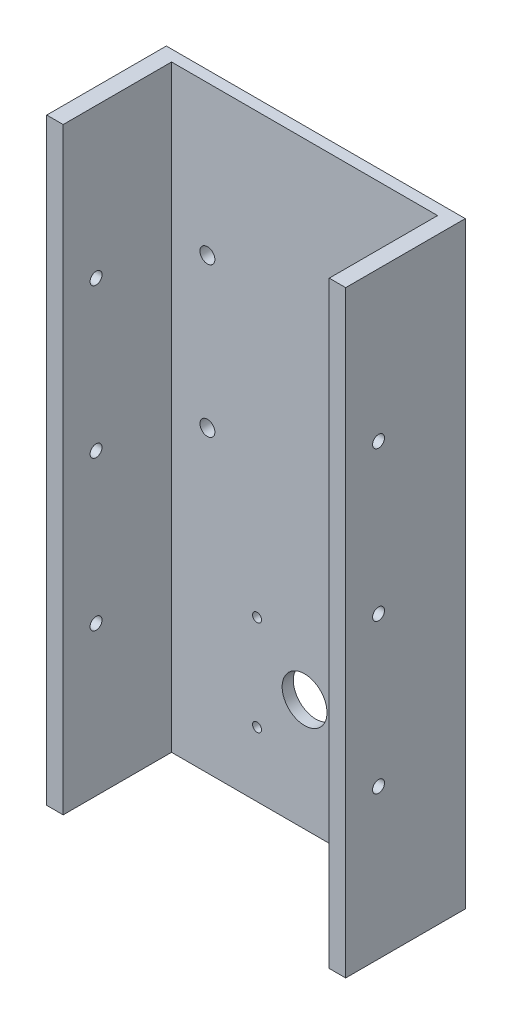
ISO-10303-21;
HEADER;
FILE_DESCRIPTION(('STEP AP214'),'2;1');
FILE_NAME('part.step','',(''),(''),'','','');
FILE_SCHEMA(('AUTOMOTIVE_DESIGN { 1 0 10303 214 1 1 1 1 }'));
ENDSEC;
DATA;
#1=APPLICATION_CONTEXT('core data for automotive mechanical design processes');
#2=APPLICATION_PROTOCOL_DEFINITION('international standard','automotive_design',2000,#1);
#3=PRODUCT_CONTEXT('',#1,'mechanical');
#4=PRODUCT('Part','Part','',(#3));
#5=PRODUCT_RELATED_PRODUCT_CATEGORY('part','',(#4));
#6=PRODUCT_DEFINITION_FORMATION('','',#4);
#7=PRODUCT_DEFINITION_CONTEXT('part definition',#1,'design');
#8=PRODUCT_DEFINITION('design','',#6,#7);
#9=PRODUCT_DEFINITION_SHAPE('','',#8);
#10=(LENGTH_UNIT() NAMED_UNIT(*) SI_UNIT(.MILLI.,.METRE.));
#11=(NAMED_UNIT(*) PLANE_ANGLE_UNIT() SI_UNIT($,.RADIAN.));
#12=(NAMED_UNIT(*) SI_UNIT($,.STERADIAN.) SOLID_ANGLE_UNIT());
#13=UNCERTAINTY_MEASURE_WITH_UNIT(LENGTH_MEASURE(1.E-05),#10,'distance_accuracy_value','');
#14=(GEOMETRIC_REPRESENTATION_CONTEXT(3) GLOBAL_UNCERTAINTY_ASSIGNED_CONTEXT((#13)) GLOBAL_UNIT_ASSIGNED_CONTEXT((#10,
#11,#12)) REPRESENTATION_CONTEXT('',''));
#15=CARTESIAN_POINT('',(0.,0.,0.));
#16=DIRECTION('',(0.,0.,1.));
#17=DIRECTION('',(1.,0.,0.));
#18=AXIS2_PLACEMENT_3D('',#15,#16,#17);
#19=CARTESIAN_POINT('',(0.,0.,7.5));
#20=DIRECTION('',(0.,0.,-1.));
#21=DIRECTION('',(-1.,0.,0.));
#22=AXIS2_PLACEMENT_3D('',#19,#20,#21);
#23=PLANE('',#22);
#24=CARTESIAN_POINT('',(-31.7973148823079,-93.2026851176921,7.5));
#25=DIRECTION('',(0.,0.,-1.));
#26=DIRECTION('',(-1.,0.,0.));
#27=AXIS2_PLACEMENT_3D('',#24,#25,#26);
#28=CIRCLE('',#27,3.);
#29=CARTESIAN_POINT('',(-34.7973148823079,-93.2026851176921,7.5));
#30=VERTEX_POINT('',#29);
#31=EDGE_CURVE('E237',#30,#30,#28,.T.);
#32=ORIENTED_EDGE('',*,*,#31,.T.);
#33=EDGE_LOOP('',(#32));
#34=FACE_BOUND('',#33,.T.);
#35=CARTESIAN_POINT('',(31.797314882308,-93.2026851176922,7.5));
#36=DIRECTION('',(0.,0.,-1.));
#37=DIRECTION('',(-1.,0.,0.));
#38=AXIS2_PLACEMENT_3D('',#35,#36,#37);
#39=CIRCLE('',#38,3.);
#40=CARTESIAN_POINT('',(28.797314882308,-93.2026851176922,7.5));
#41=VERTEX_POINT('',#40);
#42=EDGE_CURVE('E240',#41,#41,#39,.F.);
#43=ORIENTED_EDGE('',*,*,#42,.F.);
#44=EDGE_LOOP('',(#43));
#45=FACE_BOUND('',#44,.T.);
#46=CARTESIAN_POINT('',(-65.,0.,7.5));
#47=DIRECTION('',(0.,0.,1.));
#48=DIRECTION('',(1.,0.,0.));
#49=AXIS2_PLACEMENT_3D('',#46,#47,#48);
#50=CIRCLE('',#49,5.);
#51=CARTESIAN_POINT('',(-60.,0.,7.5));
#52=VERTEX_POINT('',#51);
#53=EDGE_CURVE('E181',#52,#52,#50,.T.);
#54=ORIENTED_EDGE('',*,*,#53,.F.);
#55=EDGE_LOOP('',(#54));
#56=FACE_BOUND('',#55,.T.);
#57=CARTESIAN_POINT('',(-65.,100.,7.5));
#58=DIRECTION('',(0.,0.,1.));
#59=DIRECTION('',(1.,0.,0.));
#60=AXIS2_PLACEMENT_3D('',#57,#58,#59);
#61=CIRCLE('',#60,5.);
#62=CARTESIAN_POINT('',(-60.,100.,7.5));
#63=VERTEX_POINT('',#62);
#64=EDGE_CURVE('E175',#63,#63,#61,.T.);
#65=ORIENTED_EDGE('',*,*,#64,.F.);
#66=EDGE_LOOP('',(#65));
#67=FACE_BOUND('',#66,.T.);
#68=CARTESIAN_POINT('',(65.,100.,7.5));
#69=DIRECTION('',(0.,0.,1.));
#70=DIRECTION('',(1.,0.,0.));
#71=AXIS2_PLACEMENT_3D('',#68,#69,#70);
#72=CIRCLE('',#71,5.00000000000001);
#73=CARTESIAN_POINT('',(70.,100.,7.5));
#74=VERTEX_POINT('',#73);
#75=EDGE_CURVE('E169',#74,#74,#72,.T.);
#76=ORIENTED_EDGE('',*,*,#75,.F.);
#77=EDGE_LOOP('',(#76));
#78=FACE_BOUND('',#77,.T.);
#79=CARTESIAN_POINT('',(65.,0.,7.5));
#80=DIRECTION('',(0.,0.,1.));
#81=DIRECTION('',(1.,0.,0.));
#82=AXIS2_PLACEMENT_3D('',#79,#80,#81);
#83=CIRCLE('',#82,5.);
#84=CARTESIAN_POINT('',(70.,0.,7.5));
#85=VERTEX_POINT('',#84);
#86=EDGE_CURVE('E163',#85,#85,#83,.T.);
#87=ORIENTED_EDGE('',*,*,#86,.F.);
#88=EDGE_LOOP('',(#87));
#89=FACE_BOUND('',#88,.T.);
#90=CARTESIAN_POINT('',(0.,-125.,7.5));
#91=DIRECTION('',(0.,0.,1.));
#92=DIRECTION('',(1.,0.,0.));
#93=AXIS2_PLACEMENT_3D('',#90,#91,#92);
#94=CIRCLE('',#93,15.);
#95=CARTESIAN_POINT('',(15.,-125.,7.5));
#96=VERTEX_POINT('',#95);
#97=EDGE_CURVE('E157',#96,#96,#94,.T.);
#98=ORIENTED_EDGE('',*,*,#97,.F.);
#99=EDGE_LOOP('',(#98));
#100=FACE_BOUND('',#99,.T.);
#101=DIRECTION('',(0.,-1.,0.));
#102=VECTOR('',#101,1.);
#103=CARTESIAN_POINT('',(89.0000000000001,200.,7.5));
#104=LINE('',#103,#102);
#105=CARTESIAN_POINT('',(89.0000000000001,200.,7.5));
#106=VERTEX_POINT('',#105);
#107=CARTESIAN_POINT('',(89.0000000000001,-200.,7.5));
#108=VERTEX_POINT('',#107);
#109=EDGE_CURVE('E52',#106,#108,#104,.T.);
#110=ORIENTED_EDGE('',*,*,#109,.F.);
#111=DIRECTION('',(-1.,0.,0.));
#112=VECTOR('',#111,1.);
#113=CARTESIAN_POINT('',(-99.9999999999999,200.,7.5));
#114=LINE('',#113,#112);
#115=CARTESIAN_POINT('',(-88.9999999999999,200.,7.5));
#116=VERTEX_POINT('',#115);
#117=EDGE_CURVE('E187',#106,#116,#114,.T.);
#118=ORIENTED_EDGE('',*,*,#117,.T.);
#119=DIRECTION('',(0.,1.,0.));
#120=VECTOR('',#119,1.);
#121=CARTESIAN_POINT('',(-88.9999999999999,200.,7.5));
#122=LINE('',#121,#120);
#123=CARTESIAN_POINT('',(-88.9999999999999,-200.,7.5));
#124=VERTEX_POINT('',#123);
#125=EDGE_CURVE('E137',#124,#116,#122,.T.);
#126=ORIENTED_EDGE('',*,*,#125,.F.);
#127=DIRECTION('',(1.,0.,0.));
#128=VECTOR('',#127,1.);
#129=CARTESIAN_POINT('',(100.,-200.,7.5));
#130=LINE('',#129,#128);
#131=EDGE_CURVE('E57',#124,#108,#130,.T.);
#132=ORIENTED_EDGE('',*,*,#131,.T.);
#133=EDGE_LOOP('',(#110,#118,#126,#132));
#134=FACE_BOUND('',#133,.T.);
#135=CARTESIAN_POINT('',(-31.7973148823079,-156.797314882308,7.5));
#136=DIRECTION('',(0.,0.,-1.));
#137=DIRECTION('',(-1.,0.,0.));
#138=AXIS2_PLACEMENT_3D('',#135,#136,#137);
#139=CIRCLE('',#138,3.);
#140=CARTESIAN_POINT('',(-34.7973148823079,-156.797314882308,7.5));
#141=VERTEX_POINT('',#140);
#142=EDGE_CURVE('E234',#141,#141,#139,.F.);
#143=ORIENTED_EDGE('',*,*,#142,.F.);
#144=EDGE_LOOP('',(#143));
#145=FACE_BOUND('',#144,.T.);
#146=CARTESIAN_POINT('',(31.797314882308,-156.797314882308,7.5));
#147=DIRECTION('',(0.,0.,-1.));
#148=DIRECTION('',(-1.,0.,0.));
#149=AXIS2_PLACEMENT_3D('',#146,#147,#148);
#150=CIRCLE('',#149,3.);
#151=CARTESIAN_POINT('',(28.797314882308,-156.797314882308,7.5));
#152=VERTEX_POINT('',#151);
#153=EDGE_CURVE('E218',#152,#152,#150,.T.);
#154=ORIENTED_EDGE('',*,*,#153,.T.);
#155=EDGE_LOOP('',(#154));
#156=FACE_BOUND('',#155,.T.);
#157=ADVANCED_FACE('F35',(#34,#45,#56,#67,#78,#89,#100,#134,#145,#156),#23,.F.);
#158=CARTESIAN_POINT('',(0.,0.,0.));
#159=DIRECTION('',(0.,0.,-1.));
#160=DIRECTION('',(-1.,0.,0.));
#161=AXIS2_PLACEMENT_3D('',#158,#159,#160);
#162=PLANE('',#161);
#163=CARTESIAN_POINT('',(-31.7973148823079,-156.797314882308,0.));
#164=DIRECTION('',(0.,0.,1.));
#165=DIRECTION('',(1.,0.,0.));
#166=AXIS2_PLACEMENT_3D('',#163,#164,#165);
#167=CIRCLE('',#166,3.);
#168=CARTESIAN_POINT('',(-28.7973148823079,-156.797314882308,0.));
#169=VERTEX_POINT('',#168);
#170=EDGE_CURVE('E250',#169,#169,#167,.T.);
#171=ORIENTED_EDGE('',*,*,#170,.T.);
#172=EDGE_LOOP('',(#171));
#173=FACE_BOUND('',#172,.T.);
#174=CARTESIAN_POINT('',(31.797314882308,-93.2026851176922,0.));
#175=DIRECTION('',(0.,0.,1.));
#176=DIRECTION('',(1.,0.,0.));
#177=AXIS2_PLACEMENT_3D('',#174,#175,#176);
#178=CIRCLE('',#177,3.);
#179=CARTESIAN_POINT('',(34.797314882308,-93.2026851176922,0.));
#180=VERTEX_POINT('',#179);
#181=EDGE_CURVE('E243',#180,#180,#178,.T.);
#182=ORIENTED_EDGE('',*,*,#181,.T.);
#183=EDGE_LOOP('',(#182));
#184=FACE_BOUND('',#183,.T.);
#185=CARTESIAN_POINT('',(65.,0.,0.));
#186=DIRECTION('',(0.,0.,1.));
#187=DIRECTION('',(1.,0.,0.));
#188=AXIS2_PLACEMENT_3D('',#185,#186,#187);
#189=CIRCLE('',#188,5.);
#190=CARTESIAN_POINT('',(70.,0.,0.));
#191=VERTEX_POINT('',#190);
#192=EDGE_CURVE('E160',#191,#191,#189,.T.);
#193=ORIENTED_EDGE('',*,*,#192,.T.);
#194=EDGE_LOOP('',(#193));
#195=FACE_BOUND('',#194,.T.);
#196=CARTESIAN_POINT('',(-65.,100.,0.));
#197=DIRECTION('',(0.,0.,1.));
#198=DIRECTION('',(1.,0.,0.));
#199=AXIS2_PLACEMENT_3D('',#196,#197,#198);
#200=CIRCLE('',#199,5.);
#201=CARTESIAN_POINT('',(-60.,100.,0.));
#202=VERTEX_POINT('',#201);
#203=EDGE_CURVE('E172',#202,#202,#200,.T.);
#204=ORIENTED_EDGE('',*,*,#203,.T.);
#205=EDGE_LOOP('',(#204));
#206=FACE_BOUND('',#205,.T.);
#207=DIRECTION('',(-1.,0.,0.));
#208=VECTOR('',#207,1.);
#209=CARTESIAN_POINT('',(-99.9999999999999,200.,0.));
#210=LINE('',#209,#208);
#211=CARTESIAN_POINT('',(100.,200.,0.));
#212=VERTEX_POINT('',#211);
#213=CARTESIAN_POINT('',(-99.9999999999999,200.,0.));
#214=VERTEX_POINT('',#213);
#215=EDGE_CURVE('E184',#212,#214,#210,.T.);
#216=ORIENTED_EDGE('',*,*,#215,.F.);
#217=DIRECTION('',(0.,1.,0.));
#218=VECTOR('',#217,1.);
#219=CARTESIAN_POINT('',(100.,200.,0.));
#220=LINE('',#219,#218);
#221=CARTESIAN_POINT('',(100.,-200.,0.));
#222=VERTEX_POINT('',#221);
#223=EDGE_CURVE('E107',#222,#212,#220,.T.);
#224=ORIENTED_EDGE('',*,*,#223,.F.);
#225=DIRECTION('',(1.,0.,0.));
#226=VECTOR('',#225,1.);
#227=CARTESIAN_POINT('',(100.,-200.,0.));
#228=LINE('',#227,#226);
#229=CARTESIAN_POINT('',(-99.9999999999999,-200.,0.));
#230=VERTEX_POINT('',#229);
#231=EDGE_CURVE('E193',#230,#222,#228,.T.);
#232=ORIENTED_EDGE('',*,*,#231,.F.);
#233=DIRECTION('',(0.,-1.,0.));
#234=VECTOR('',#233,1.);
#235=CARTESIAN_POINT('',(-99.9999999999999,-200.,0.));
#236=LINE('',#235,#234);
#237=EDGE_CURVE('E191',#214,#230,#236,.T.);
#238=ORIENTED_EDGE('',*,*,#237,.F.);
#239=EDGE_LOOP('',(#216,#224,#232,#238));
#240=FACE_BOUND('',#239,.T.);
#241=CARTESIAN_POINT('',(-65.,0.,0.));
#242=DIRECTION('',(0.,0.,1.));
#243=DIRECTION('',(1.,0.,0.));
#244=AXIS2_PLACEMENT_3D('',#241,#242,#243);
#245=CIRCLE('',#244,5.);
#246=CARTESIAN_POINT('',(-60.,0.,0.));
#247=VERTEX_POINT('',#246);
#248=EDGE_CURVE('E178',#247,#247,#245,.T.);
#249=ORIENTED_EDGE('',*,*,#248,.T.);
#250=EDGE_LOOP('',(#249));
#251=FACE_BOUND('',#250,.T.);
#252=CARTESIAN_POINT('',(65.,100.,0.));
#253=DIRECTION('',(0.,0.,1.));
#254=DIRECTION('',(1.,0.,0.));
#255=AXIS2_PLACEMENT_3D('',#252,#253,#254);
#256=CIRCLE('',#255,5.00000000000001);
#257=CARTESIAN_POINT('',(70.,100.,0.));
#258=VERTEX_POINT('',#257);
#259=EDGE_CURVE('E166',#258,#258,#256,.T.);
#260=ORIENTED_EDGE('',*,*,#259,.T.);
#261=EDGE_LOOP('',(#260));
#262=FACE_BOUND('',#261,.T.);
#263=CARTESIAN_POINT('',(0.,-125.,0.));
#264=DIRECTION('',(0.,0.,1.));
#265=DIRECTION('',(1.,0.,0.));
#266=AXIS2_PLACEMENT_3D('',#263,#264,#265);
#267=CIRCLE('',#266,15.);
#268=CARTESIAN_POINT('',(15.,-125.,0.));
#269=VERTEX_POINT('',#268);
#270=EDGE_CURVE('E156',#269,#269,#267,.T.);
#271=ORIENTED_EDGE('',*,*,#270,.T.);
#272=EDGE_LOOP('',(#271));
#273=FACE_BOUND('',#272,.T.);
#274=CARTESIAN_POINT('',(-31.7973148823079,-93.2026851176921,0.));
#275=DIRECTION('',(0.,0.,1.));
#276=DIRECTION('',(1.,0.,0.));
#277=AXIS2_PLACEMENT_3D('',#274,#275,#276);
#278=CIRCLE('',#277,3.);
#279=CARTESIAN_POINT('',(-28.7973148823079,-93.2026851176921,0.));
#280=VERTEX_POINT('',#279);
#281=EDGE_CURVE('E246',#280,#280,#278,.F.);
#282=ORIENTED_EDGE('',*,*,#281,.F.);
#283=EDGE_LOOP('',(#282));
#284=FACE_BOUND('',#283,.T.);
#285=CARTESIAN_POINT('',(31.797314882308,-156.797314882308,0.));
#286=DIRECTION('',(0.,0.,1.));
#287=DIRECTION('',(1.,0.,0.));
#288=AXIS2_PLACEMENT_3D('',#285,#286,#287);
#289=CIRCLE('',#288,3.);
#290=CARTESIAN_POINT('',(34.797314882308,-156.797314882308,0.));
#291=VERTEX_POINT('',#290);
#292=EDGE_CURVE('E247',#291,#291,#289,.F.);
#293=ORIENTED_EDGE('',*,*,#292,.F.);
#294=EDGE_LOOP('',(#293));
#295=FACE_BOUND('',#294,.T.);
#296=ADVANCED_FACE('F259',(#173,#184,#195,#206,#240,#251,#262,#273,#284,#295),#162,.T.);
#297=CARTESIAN_POINT('',(-99.9999999999999,200.,7.5));
#298=DIRECTION('',(0.,-1.,0.));
#299=DIRECTION('',(0.,0.,-1.));
#300=AXIS2_PLACEMENT_3D('',#297,#298,#299);
#301=PLANE('',#300);
#302=ORIENTED_EDGE('',*,*,#215,.T.);
#303=DIRECTION('',(0.,0.,-1.));
#304=VECTOR('',#303,1.);
#305=CARTESIAN_POINT('',(-99.9999999999999,200.,7.5));
#306=LINE('',#305,#304);
#307=CARTESIAN_POINT('',(-99.9999999999999,200.,80.));
#308=VERTEX_POINT('',#307);
#309=EDGE_CURVE('E11',#308,#214,#306,.T.);
#310=ORIENTED_EDGE('',*,*,#309,.F.);
#311=DIRECTION('',(-1.,0.,0.));
#312=VECTOR('',#311,1.);
#313=CARTESIAN_POINT('',(-99.9999999999999,200.,80.));
#314=LINE('',#313,#312);
#315=CARTESIAN_POINT('',(-88.9999999999999,200.,80.));
#316=VERTEX_POINT('',#315);
#317=EDGE_CURVE('E145',#316,#308,#314,.T.);
#318=ORIENTED_EDGE('',*,*,#317,.F.);
#319=DIRECTION('',(0.,0.,-1.));
#320=VECTOR('',#319,1.);
#321=CARTESIAN_POINT('',(-88.9999999999999,200.,80.));
#322=LINE('',#321,#320);
#323=EDGE_CURVE('E148',#316,#116,#322,.T.);
#324=ORIENTED_EDGE('',*,*,#323,.T.);
#325=ORIENTED_EDGE('',*,*,#117,.F.);
#326=DIRECTION('',(0.,0.,-1.));
#327=VECTOR('',#326,1.);
#328=CARTESIAN_POINT('',(89.0000000000001,200.,80.));
#329=LINE('',#328,#327);
#330=CARTESIAN_POINT('',(89.0000000000001,200.,80.));
#331=VERTEX_POINT('',#330);
#332=EDGE_CURVE('E116',#331,#106,#329,.T.);
#333=ORIENTED_EDGE('',*,*,#332,.F.);
#334=DIRECTION('',(-1.,0.,0.));
#335=VECTOR('',#334,1.);
#336=CARTESIAN_POINT('',(100.,200.,80.));
#337=LINE('',#336,#335);
#338=CARTESIAN_POINT('',(100.,200.,80.));
#339=VERTEX_POINT('',#338);
#340=EDGE_CURVE('E114',#339,#331,#337,.T.);
#341=ORIENTED_EDGE('',*,*,#340,.F.);
#342=DIRECTION('',(0.,0.,-1.));
#343=VECTOR('',#342,1.);
#344=CARTESIAN_POINT('',(100.,200.,7.5));
#345=LINE('',#344,#343);
#346=EDGE_CURVE('E100',#339,#212,#345,.T.);
#347=ORIENTED_EDGE('',*,*,#346,.T.);
#348=EDGE_LOOP('',(#302,#310,#318,#324,#325,#333,#341,#347));
#349=FACE_BOUND('',#348,.T.);
#350=ADVANCED_FACE('F37',(#349),#301,.F.);
#351=CARTESIAN_POINT('',(-99.9999999999999,-200.,7.5));
#352=DIRECTION('',(1.,0.,0.));
#353=DIRECTION('',(0.,0.,-1.));
#354=AXIS2_PLACEMENT_3D('',#351,#352,#353);
#355=PLANE('',#354);
#356=CARTESIAN_POINT('',(-99.9999999999999,100.,58.));
#357=DIRECTION('',(1.,0.,0.));
#358=DIRECTION('',(0.,0.,-1.));
#359=AXIS2_PLACEMENT_3D('',#356,#357,#358);
#360=CIRCLE('',#359,4.00000000000001);
#361=CARTESIAN_POINT('',(-99.9999999999999,100.,54.));
#362=VERTEX_POINT('',#361);
#363=EDGE_CURVE('E202',#362,#362,#360,.T.);
#364=ORIENTED_EDGE('',*,*,#363,.T.);
#365=EDGE_LOOP('',(#364));
#366=FACE_BOUND('',#365,.T.);
#367=CARTESIAN_POINT('',(-99.9999999999999,0.,58.));
#368=DIRECTION('',(1.,0.,0.));
#369=DIRECTION('',(0.,0.,-1.));
#370=AXIS2_PLACEMENT_3D('',#367,#368,#369);
#371=CIRCLE('',#370,4.);
#372=CARTESIAN_POINT('',(-99.9999999999999,0.,54.));
#373=VERTEX_POINT('',#372);
#374=EDGE_CURVE('E224',#373,#373,#371,.T.);
#375=ORIENTED_EDGE('',*,*,#374,.T.);
#376=EDGE_LOOP('',(#375));
#377=FACE_BOUND('',#376,.T.);
#378=CARTESIAN_POINT('',(-99.9999999999999,-100.,58.));
#379=DIRECTION('',(1.,0.,0.));
#380=DIRECTION('',(0.,0.,-1.));
#381=AXIS2_PLACEMENT_3D('',#378,#379,#380);
#382=CIRCLE('',#381,4.00000000000001);
#383=CARTESIAN_POINT('',(-99.9999999999999,-100.,54.));
#384=VERTEX_POINT('',#383);
#385=EDGE_CURVE('E217',#384,#384,#382,.T.);
#386=ORIENTED_EDGE('',*,*,#385,.T.);
#387=EDGE_LOOP('',(#386));
#388=FACE_BOUND('',#387,.T.);
#389=ORIENTED_EDGE('',*,*,#237,.T.);
#390=DIRECTION('',(0.,0.,-1.));
#391=VECTOR('',#390,1.);
#392=CARTESIAN_POINT('',(-99.9999999999999,-200.,7.5));
#393=LINE('',#392,#391);
#394=CARTESIAN_POINT('',(-99.9999999999999,-200.,80.));
#395=VERTEX_POINT('',#394);
#396=EDGE_CURVE('E44',#395,#230,#393,.T.);
#397=ORIENTED_EDGE('',*,*,#396,.F.);
#398=DIRECTION('',(0.,-1.,0.));
#399=VECTOR('',#398,1.);
#400=CARTESIAN_POINT('',(-99.9999999999999,-200.,80.));
#401=LINE('',#400,#399);
#402=EDGE_CURVE('E138',#308,#395,#401,.T.);
#403=ORIENTED_EDGE('',*,*,#402,.F.);
#404=ORIENTED_EDGE('',*,*,#309,.T.);
#405=EDGE_LOOP('',(#389,#397,#403,#404));
#406=FACE_BOUND('',#405,.T.);
#407=ADVANCED_FACE('F288',(#366,#377,#388,#406),#355,.F.);
#408=CARTESIAN_POINT('',(100.,-200.,7.5));
#409=DIRECTION('',(0.,1.,0.));
#410=DIRECTION('',(-1.,0.,0.));
#411=AXIS2_PLACEMENT_3D('',#408,#409,#410);
#412=PLANE('',#411);
#413=ORIENTED_EDGE('',*,*,#231,.T.);
#414=DIRECTION('',(0.,0.,-1.));
#415=VECTOR('',#414,1.);
#416=CARTESIAN_POINT('',(100.,-200.,7.5));
#417=LINE('',#416,#415);
#418=CARTESIAN_POINT('',(100.,-200.,80.));
#419=VERTEX_POINT('',#418);
#420=EDGE_CURVE('E111',#419,#222,#417,.T.);
#421=ORIENTED_EDGE('',*,*,#420,.F.);
#422=DIRECTION('',(1.,0.,0.));
#423=VECTOR('',#422,1.);
#424=CARTESIAN_POINT('',(89.0000000000001,-200.,80.));
#425=LINE('',#424,#423);
#426=CARTESIAN_POINT('',(89.0000000000001,-200.,80.));
#427=VERTEX_POINT('',#426);
#428=EDGE_CURVE('E124',#427,#419,#425,.T.);
#429=ORIENTED_EDGE('',*,*,#428,.F.);
#430=DIRECTION('',(0.,0.,-1.));
#431=VECTOR('',#430,1.);
#432=CARTESIAN_POINT('',(89.0000000000001,-200.,80.));
#433=LINE('',#432,#431);
#434=EDGE_CURVE('E132',#427,#108,#433,.T.);
#435=ORIENTED_EDGE('',*,*,#434,.T.);
#436=ORIENTED_EDGE('',*,*,#131,.F.);
#437=DIRECTION('',(0.,0.,-1.));
#438=VECTOR('',#437,1.);
#439=CARTESIAN_POINT('',(-88.9999999999999,-200.,80.));
#440=LINE('',#439,#438);
#441=CARTESIAN_POINT('',(-88.9999999999999,-200.,80.));
#442=VERTEX_POINT('',#441);
#443=EDGE_CURVE('E153',#442,#124,#440,.T.);
#444=ORIENTED_EDGE('',*,*,#443,.F.);
#445=DIRECTION('',(1.,0.,0.));
#446=VECTOR('',#445,1.);
#447=CARTESIAN_POINT('',(-88.9999999999999,-200.,80.));
#448=LINE('',#447,#446);
#449=EDGE_CURVE('E141',#395,#442,#448,.T.);
#450=ORIENTED_EDGE('',*,*,#449,.F.);
#451=ORIENTED_EDGE('',*,*,#396,.T.);
#452=EDGE_LOOP('',(#413,#421,#429,#435,#436,#444,#450,#451));
#453=FACE_BOUND('',#452,.T.);
#454=ADVANCED_FACE('F285',(#453),#412,.F.);
#455=CARTESIAN_POINT('',(100.,200.,7.5));
#456=DIRECTION('',(-1.,0.,0.));
#457=DIRECTION('',(0.,0.,1.));
#458=AXIS2_PLACEMENT_3D('',#455,#456,#457);
#459=PLANE('',#458);
#460=CARTESIAN_POINT('',(100.,100.,58.));
#461=DIRECTION('',(1.,0.,0.));
#462=DIRECTION('',(0.,0.,-1.));
#463=AXIS2_PLACEMENT_3D('',#460,#461,#462);
#464=CIRCLE('',#463,4.00000000000001);
#465=CARTESIAN_POINT('',(100.,100.,54.));
#466=VERTEX_POINT('',#465);
#467=EDGE_CURVE('E227',#466,#466,#464,.T.);
#468=ORIENTED_EDGE('',*,*,#467,.F.);
#469=EDGE_LOOP('',(#468));
#470=FACE_BOUND('',#469,.T.);
#471=CARTESIAN_POINT('',(100.,0.,58.));
#472=DIRECTION('',(1.,0.,0.));
#473=DIRECTION('',(0.,0.,-1.));
#474=AXIS2_PLACEMENT_3D('',#471,#472,#473);
#475=CIRCLE('',#474,4.);
#476=CARTESIAN_POINT('',(100.,0.,54.));
#477=VERTEX_POINT('',#476);
#478=EDGE_CURVE('E221',#477,#477,#475,.T.);
#479=ORIENTED_EDGE('',*,*,#478,.F.);
#480=EDGE_LOOP('',(#479));
#481=FACE_BOUND('',#480,.T.);
#482=CARTESIAN_POINT('',(100.,-100.,58.));
#483=DIRECTION('',(1.,0.,0.));
#484=DIRECTION('',(0.,0.,-1.));
#485=AXIS2_PLACEMENT_3D('',#482,#483,#484);
#486=CIRCLE('',#485,4.00000000000001);
#487=CARTESIAN_POINT('',(100.,-100.,54.));
#488=VERTEX_POINT('',#487);
#489=EDGE_CURVE('E214',#488,#488,#486,.T.);
#490=ORIENTED_EDGE('',*,*,#489,.F.);
#491=EDGE_LOOP('',(#490));
#492=FACE_BOUND('',#491,.T.);
#493=ORIENTED_EDGE('',*,*,#223,.T.);
#494=ORIENTED_EDGE('',*,*,#346,.F.);
#495=DIRECTION('',(0.,1.,0.));
#496=VECTOR('',#495,1.);
#497=CARTESIAN_POINT('',(100.,-200.,80.));
#498=LINE('',#497,#496);
#499=EDGE_CURVE('E105',#419,#339,#498,.T.);
#500=ORIENTED_EDGE('',*,*,#499,.F.);
#501=ORIENTED_EDGE('',*,*,#420,.T.);
#502=EDGE_LOOP('',(#493,#494,#500,#501));
#503=FACE_BOUND('',#502,.T.);
#504=ADVANCED_FACE('F102',(#470,#481,#492,#503),#459,.F.);
#505=CARTESIAN_POINT('',(-65.,0.,7.5));
#506=DIRECTION('',(0.,0.,-1.));
#507=DIRECTION('',(-1.,0.,0.));
#508=AXIS2_PLACEMENT_3D('',#505,#506,#507);
#509=CYLINDRICAL_SURFACE('',#508,5.);
#510=ORIENTED_EDGE('',*,*,#53,.T.);
#511=EDGE_LOOP('',(#510));
#512=FACE_BOUND('',#511,.T.);
#513=ORIENTED_EDGE('',*,*,#248,.F.);
#514=EDGE_LOOP('',(#513));
#515=FACE_BOUND('',#514,.T.);
#516=ADVANCED_FACE('F280',(#512,#515),#509,.F.);
#517=CARTESIAN_POINT('',(-65.,100.,7.5));
#518=DIRECTION('',(0.,0.,-1.));
#519=DIRECTION('',(-1.,0.,0.));
#520=AXIS2_PLACEMENT_3D('',#517,#518,#519);
#521=CYLINDRICAL_SURFACE('',#520,5.);
#522=ORIENTED_EDGE('',*,*,#64,.T.);
#523=EDGE_LOOP('',(#522));
#524=FACE_BOUND('',#523,.T.);
#525=ORIENTED_EDGE('',*,*,#203,.F.);
#526=EDGE_LOOP('',(#525));
#527=FACE_BOUND('',#526,.T.);
#528=ADVANCED_FACE('F343',(#524,#527),#521,.F.);
#529=CARTESIAN_POINT('',(65.,100.,7.5));
#530=DIRECTION('',(0.,0.,-1.));
#531=DIRECTION('',(-1.,0.,0.));
#532=AXIS2_PLACEMENT_3D('',#529,#530,#531);
#533=CYLINDRICAL_SURFACE('',#532,5.00000000000001);
#534=ORIENTED_EDGE('',*,*,#75,.T.);
#535=EDGE_LOOP('',(#534));
#536=FACE_BOUND('',#535,.T.);
#537=ORIENTED_EDGE('',*,*,#259,.F.);
#538=EDGE_LOOP('',(#537));
#539=FACE_BOUND('',#538,.T.);
#540=ADVANCED_FACE('F340',(#536,#539),#533,.F.);
#541=CARTESIAN_POINT('',(65.,0.,7.5));
#542=DIRECTION('',(0.,0.,-1.));
#543=DIRECTION('',(-1.,0.,0.));
#544=AXIS2_PLACEMENT_3D('',#541,#542,#543);
#545=CYLINDRICAL_SURFACE('',#544,5.);
#546=ORIENTED_EDGE('',*,*,#86,.T.);
#547=EDGE_LOOP('',(#546));
#548=FACE_BOUND('',#547,.T.);
#549=ORIENTED_EDGE('',*,*,#192,.F.);
#550=EDGE_LOOP('',(#549));
#551=FACE_BOUND('',#550,.T.);
#552=ADVANCED_FACE('F336',(#548,#551),#545,.F.);
#553=CARTESIAN_POINT('',(0.,-125.,7.5));
#554=DIRECTION('',(0.,0.,-1.));
#555=DIRECTION('',(-1.,0.,0.));
#556=AXIS2_PLACEMENT_3D('',#553,#554,#555);
#557=CYLINDRICAL_SURFACE('',#556,15.);
#558=ORIENTED_EDGE('',*,*,#97,.T.);
#559=EDGE_LOOP('',(#558));
#560=FACE_BOUND('',#559,.T.);
#561=ORIENTED_EDGE('',*,*,#270,.F.);
#562=EDGE_LOOP('',(#561));
#563=FACE_BOUND('',#562,.T.);
#564=ADVANCED_FACE('F332',(#560,#563),#557,.F.);
#565=CARTESIAN_POINT('',(-88.9999999999999,200.,80.));
#566=DIRECTION('',(-1.,0.,0.));
#567=DIRECTION('',(0.,0.,1.));
#568=AXIS2_PLACEMENT_3D('',#565,#566,#567);
#569=PLANE('',#568);
#570=CARTESIAN_POINT('',(-88.9999999999999,100.,58.));
#571=DIRECTION('',(-1.,0.,0.));
#572=DIRECTION('',(0.,0.,1.));
#573=AXIS2_PLACEMENT_3D('',#570,#571,#572);
#574=CIRCLE('',#573,4.00000000000001);
#575=CARTESIAN_POINT('',(-88.9999999999999,100.,62.));
#576=VERTEX_POINT('',#575);
#577=EDGE_CURVE('E126',#576,#576,#574,.T.);
#578=ORIENTED_EDGE('',*,*,#577,.T.);
#579=EDGE_LOOP('',(#578));
#580=FACE_BOUND('',#579,.T.);
#581=CARTESIAN_POINT('',(-88.9999999999999,0.,58.));
#582=DIRECTION('',(-1.,0.,0.));
#583=DIRECTION('',(0.,0.,1.));
#584=AXIS2_PLACEMENT_3D('',#581,#582,#583);
#585=CIRCLE('',#584,4.);
#586=CARTESIAN_POINT('',(-88.9999999999999,0.,62.));
#587=VERTEX_POINT('',#586);
#588=EDGE_CURVE('E205',#587,#587,#585,.T.);
#589=ORIENTED_EDGE('',*,*,#588,.T.);
#590=EDGE_LOOP('',(#589));
#591=FACE_BOUND('',#590,.T.);
#592=CARTESIAN_POINT('',(-88.9999999999999,-100.,58.));
#593=DIRECTION('',(-1.,0.,0.));
#594=DIRECTION('',(0.,0.,1.));
#595=AXIS2_PLACEMENT_3D('',#592,#593,#594);
#596=CIRCLE('',#595,4.00000000000001);
#597=CARTESIAN_POINT('',(-88.9999999999999,-100.,62.));
#598=VERTEX_POINT('',#597);
#599=EDGE_CURVE('E201',#598,#598,#596,.T.);
#600=ORIENTED_EDGE('',*,*,#599,.T.);
#601=EDGE_LOOP('',(#600));
#602=FACE_BOUND('',#601,.T.);
#603=ORIENTED_EDGE('',*,*,#125,.T.);
#604=ORIENTED_EDGE('',*,*,#323,.F.);
#605=DIRECTION('',(0.,1.,0.));
#606=VECTOR('',#605,1.);
#607=CARTESIAN_POINT('',(-88.9999999999999,200.,80.));
#608=LINE('',#607,#606);
#609=EDGE_CURVE('E143',#442,#316,#608,.T.);
#610=ORIENTED_EDGE('',*,*,#609,.F.);
#611=ORIENTED_EDGE('',*,*,#443,.T.);
#612=EDGE_LOOP('',(#603,#604,#610,#611));
#613=FACE_BOUND('',#612,.T.);
#614=ADVANCED_FACE('F313',(#580,#591,#602,#613),#569,.F.);
#615=CARTESIAN_POINT('',(0.,0.,80.));
#616=DIRECTION('',(0.,0.,-1.));
#617=DIRECTION('',(-1.,0.,0.));
#618=AXIS2_PLACEMENT_3D('',#615,#616,#617);
#619=PLANE('',#618);
#620=ORIENTED_EDGE('',*,*,#402,.T.);
#621=ORIENTED_EDGE('',*,*,#449,.T.);
#622=ORIENTED_EDGE('',*,*,#609,.T.);
#623=ORIENTED_EDGE('',*,*,#317,.T.);
#624=EDGE_LOOP('',(#620,#621,#622,#623));
#625=FACE_BOUND('',#624,.T.);
#626=ADVANCED_FACE('F309',(#625),#619,.F.);
#627=CARTESIAN_POINT('',(89.0000000000001,200.,80.));
#628=DIRECTION('',(1.,0.,0.));
#629=DIRECTION('',(0.,1.,0.));
#630=AXIS2_PLACEMENT_3D('',#627,#628,#629);
#631=PLANE('',#630);
#632=CARTESIAN_POINT('',(89.0000000000001,100.,58.));
#633=DIRECTION('',(1.,0.,0.));
#634=DIRECTION('',(0.,1.,0.));
#635=AXIS2_PLACEMENT_3D('',#632,#633,#634);
#636=CIRCLE('',#635,4.00000000000001);
#637=CARTESIAN_POINT('',(89.0000000000001,104.,58.));
#638=VERTEX_POINT('',#637);
#639=EDGE_CURVE('E39',#638,#638,#636,.T.);
#640=ORIENTED_EDGE('',*,*,#639,.T.);
#641=EDGE_LOOP('',(#640));
#642=FACE_BOUND('',#641,.T.);
#643=CARTESIAN_POINT('',(89.0000000000001,0.,58.));
#644=DIRECTION('',(1.,0.,0.));
#645=DIRECTION('',(0.,1.,0.));
#646=AXIS2_PLACEMENT_3D('',#643,#644,#645);
#647=CIRCLE('',#646,4.);
#648=CARTESIAN_POINT('',(89.0000000000001,3.99999999999997,58.));
#649=VERTEX_POINT('',#648);
#650=EDGE_CURVE('E203',#649,#649,#647,.T.);
#651=ORIENTED_EDGE('',*,*,#650,.T.);
#652=EDGE_LOOP('',(#651));
#653=FACE_BOUND('',#652,.T.);
#654=CARTESIAN_POINT('',(89.0000000000001,-100.,58.));
#655=DIRECTION('',(1.,0.,0.));
#656=DIRECTION('',(0.,1.,0.));
#657=AXIS2_PLACEMENT_3D('',#654,#655,#656);
#658=CIRCLE('',#657,4.00000000000001);
#659=CARTESIAN_POINT('',(89.0000000000001,-96.,58.));
#660=VERTEX_POINT('',#659);
#661=EDGE_CURVE('E199',#660,#660,#658,.T.);
#662=ORIENTED_EDGE('',*,*,#661,.T.);
#663=EDGE_LOOP('',(#662));
#664=FACE_BOUND('',#663,.T.);
#665=ORIENTED_EDGE('',*,*,#109,.T.);
#666=ORIENTED_EDGE('',*,*,#434,.F.);
#667=DIRECTION('',(0.,-1.,0.));
#668=VECTOR('',#667,1.);
#669=CARTESIAN_POINT('',(89.0000000000001,200.,80.));
#670=LINE('',#669,#668);
#671=EDGE_CURVE('E119',#331,#427,#670,.T.);
#672=ORIENTED_EDGE('',*,*,#671,.F.);
#673=ORIENTED_EDGE('',*,*,#332,.T.);
#674=EDGE_LOOP('',(#665,#666,#672,#673));
#675=FACE_BOUND('',#674,.T.);
#676=ADVANCED_FACE('F315',(#642,#653,#664,#675),#631,.F.);
#677=CARTESIAN_POINT('',(0.,0.,80.));
#678=DIRECTION('',(0.,0.,1.));
#679=DIRECTION('',(1.,0.,0.));
#680=AXIS2_PLACEMENT_3D('',#677,#678,#679);
#681=PLANE('',#680);
#682=ORIENTED_EDGE('',*,*,#499,.T.);
#683=ORIENTED_EDGE('',*,*,#340,.T.);
#684=ORIENTED_EDGE('',*,*,#671,.T.);
#685=ORIENTED_EDGE('',*,*,#428,.T.);
#686=EDGE_LOOP('',(#682,#683,#684,#685));
#687=FACE_BOUND('',#686,.T.);
#688=ADVANCED_FACE('F122',(#687),#681,.T.);
#689=CARTESIAN_POINT('',(-99.9999999999999,-100.,58.));
#690=DIRECTION('',(1.,0.,0.));
#691=DIRECTION('',(0.,0.,-1.));
#692=AXIS2_PLACEMENT_3D('',#689,#690,#691);
#693=CYLINDRICAL_SURFACE('',#692,4.00000000000001);
#694=ORIENTED_EDGE('',*,*,#489,.T.);
#695=EDGE_LOOP('',(#694));
#696=FACE_BOUND('',#695,.T.);
#697=ORIENTED_EDGE('',*,*,#661,.F.);
#698=EDGE_LOOP('',(#697));
#699=FACE_BOUND('',#698,.T.);
#700=ADVANCED_FACE('F324',(#696,#699),#693,.F.);
#701=CARTESIAN_POINT('',(-99.9999999999999,0.,58.));
#702=DIRECTION('',(1.,0.,0.));
#703=DIRECTION('',(0.,0.,-1.));
#704=AXIS2_PLACEMENT_3D('',#701,#702,#703);
#705=CYLINDRICAL_SURFACE('',#704,4.);
#706=ORIENTED_EDGE('',*,*,#478,.T.);
#707=EDGE_LOOP('',(#706));
#708=FACE_BOUND('',#707,.T.);
#709=ORIENTED_EDGE('',*,*,#650,.F.);
#710=EDGE_LOOP('',(#709));
#711=FACE_BOUND('',#710,.T.);
#712=ADVANCED_FACE('F387',(#708,#711),#705,.F.);
#713=CARTESIAN_POINT('',(-99.9999999999999,100.,58.));
#714=DIRECTION('',(1.,0.,0.));
#715=DIRECTION('',(0.,0.,-1.));
#716=AXIS2_PLACEMENT_3D('',#713,#714,#715);
#717=CYLINDRICAL_SURFACE('',#716,4.00000000000001);
#718=ORIENTED_EDGE('',*,*,#467,.T.);
#719=EDGE_LOOP('',(#718));
#720=FACE_BOUND('',#719,.T.);
#721=ORIENTED_EDGE('',*,*,#639,.F.);
#722=EDGE_LOOP('',(#721));
#723=FACE_BOUND('',#722,.T.);
#724=ADVANCED_FACE('F383',(#720,#723),#717,.F.);
#725=ORIENTED_EDGE('',*,*,#385,.F.);
#726=EDGE_LOOP('',(#725));
#727=FACE_BOUND('',#726,.T.);
#728=ORIENTED_EDGE('',*,*,#599,.F.);
#729=EDGE_LOOP('',(#728));
#730=FACE_BOUND('',#729,.T.);
#731=ADVANCED_FACE('F385',(#727,#730),#693,.F.);
#732=ORIENTED_EDGE('',*,*,#374,.F.);
#733=EDGE_LOOP('',(#732));
#734=FACE_BOUND('',#733,.T.);
#735=ORIENTED_EDGE('',*,*,#588,.F.);
#736=EDGE_LOOP('',(#735));
#737=FACE_BOUND('',#736,.T.);
#738=ADVANCED_FACE('F381',(#734,#737),#705,.F.);
#739=ORIENTED_EDGE('',*,*,#363,.F.);
#740=EDGE_LOOP('',(#739));
#741=FACE_BOUND('',#740,.T.);
#742=ORIENTED_EDGE('',*,*,#577,.F.);
#743=EDGE_LOOP('',(#742));
#744=FACE_BOUND('',#743,.T.);
#745=ADVANCED_FACE('F377',(#741,#744),#717,.F.);
#746=CARTESIAN_POINT('',(31.797314882308,-93.2026851176922,10.));
#747=DIRECTION('',(0.,0.,-1.));
#748=DIRECTION('',(-1.,0.,0.));
#749=AXIS2_PLACEMENT_3D('',#746,#747,#748);
#750=CYLINDRICAL_SURFACE('',#749,3.);
#751=ORIENTED_EDGE('',*,*,#181,.F.);
#752=EDGE_LOOP('',(#751));
#753=FACE_BOUND('',#752,.T.);
#754=ORIENTED_EDGE('',*,*,#42,.T.);
#755=EDGE_LOOP('',(#754));
#756=FACE_BOUND('',#755,.T.);
#757=ADVANCED_FACE('F371',(#753,#756),#750,.F.);
#758=CARTESIAN_POINT('',(-31.7973148823079,-93.2026851176921,10.));
#759=DIRECTION('',(0.,0.,-1.));
#760=DIRECTION('',(-1.,0.,0.));
#761=AXIS2_PLACEMENT_3D('',#758,#759,#760);
#762=CYLINDRICAL_SURFACE('',#761,3.);
#763=ORIENTED_EDGE('',*,*,#281,.T.);
#764=EDGE_LOOP('',(#763));
#765=FACE_BOUND('',#764,.T.);
#766=ORIENTED_EDGE('',*,*,#31,.F.);
#767=EDGE_LOOP('',(#766));
#768=FACE_BOUND('',#767,.T.);
#769=ADVANCED_FACE('F256',(#765,#768),#762,.F.);
#770=CARTESIAN_POINT('',(-31.7973148823079,-156.797314882308,10.));
#771=DIRECTION('',(0.,0.,-1.));
#772=DIRECTION('',(-1.,0.,0.));
#773=AXIS2_PLACEMENT_3D('',#770,#771,#772);
#774=CYLINDRICAL_SURFACE('',#773,3.);
#775=ORIENTED_EDGE('',*,*,#170,.F.);
#776=EDGE_LOOP('',(#775));
#777=FACE_BOUND('',#776,.T.);
#778=ORIENTED_EDGE('',*,*,#142,.T.);
#779=EDGE_LOOP('',(#778));
#780=FACE_BOUND('',#779,.T.);
#781=ADVANCED_FACE('F269',(#777,#780),#774,.F.);
#782=CARTESIAN_POINT('',(31.797314882308,-156.797314882308,10.));
#783=DIRECTION('',(0.,0.,-1.));
#784=DIRECTION('',(-1.,0.,0.));
#785=AXIS2_PLACEMENT_3D('',#782,#783,#784);
#786=CYLINDRICAL_SURFACE('',#785,3.);
#787=ORIENTED_EDGE('',*,*,#292,.T.);
#788=EDGE_LOOP('',(#787));
#789=FACE_BOUND('',#788,.T.);
#790=ORIENTED_EDGE('',*,*,#153,.F.);
#791=EDGE_LOOP('',(#790));
#792=FACE_BOUND('',#791,.T.);
#793=ADVANCED_FACE('F266',(#789,#792),#786,.F.);
#794=CLOSED_SHELL('',(#157,#296,#350,#407,#454,#504,#516,#528,#540,#552,#564,#614,#626,#676,
#688,#700,#712,#724,#731,#738,#745,#757,#769,#781,#793));
#795=MANIFOLD_SOLID_BREP('B2',#794);
#796=ADVANCED_BREP_SHAPE_REPRESENTATION('',(#18,#795),#14);
#797=SHAPE_DEFINITION_REPRESENTATION(#9,#796);
ENDSEC;
END-ISO-10303-21;
